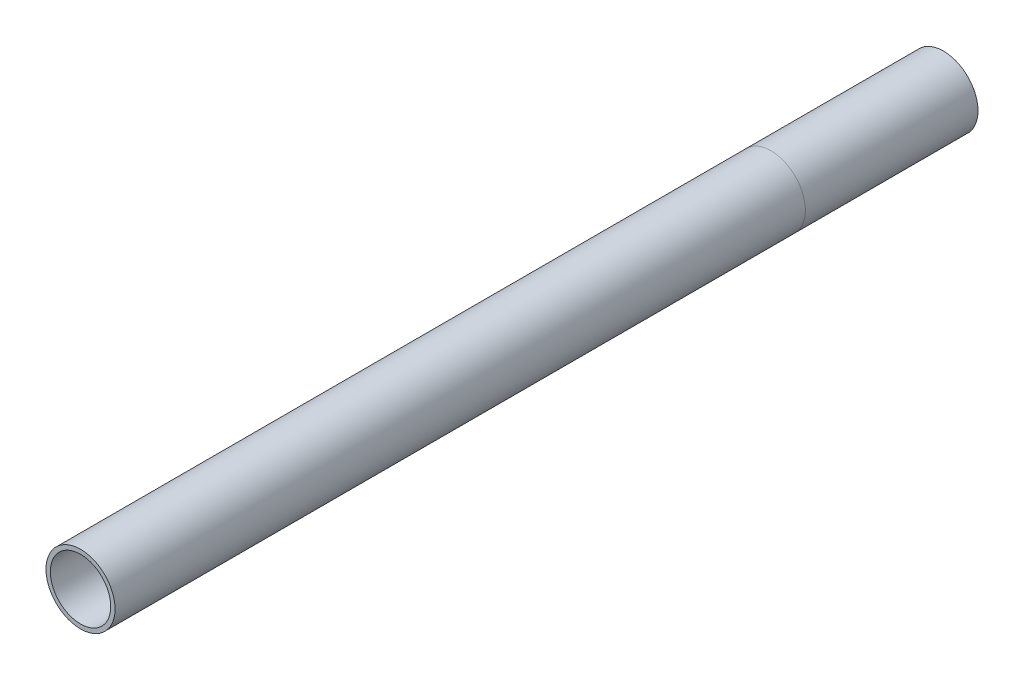
ISO-10303-21;
HEADER;
FILE_DESCRIPTION(('STEP AP214'),'2;1');
FILE_NAME('part.step','',(''),(''),'','','');
FILE_SCHEMA(('AUTOMOTIVE_DESIGN { 1 0 10303 214 1 1 1 1 }'));
ENDSEC;
DATA;
#1=APPLICATION_CONTEXT('core data for automotive mechanical design processes');
#2=APPLICATION_PROTOCOL_DEFINITION('international standard','automotive_design',2000,#1);
#3=PRODUCT_CONTEXT('',#1,'mechanical');
#4=PRODUCT('Part','Part','',(#3));
#5=PRODUCT_RELATED_PRODUCT_CATEGORY('part','',(#4));
#6=PRODUCT_DEFINITION_FORMATION('','',#4);
#7=PRODUCT_DEFINITION_CONTEXT('part definition',#1,'design');
#8=PRODUCT_DEFINITION('design','',#6,#7);
#9=PRODUCT_DEFINITION_SHAPE('','',#8);
#10=(LENGTH_UNIT() NAMED_UNIT(*) SI_UNIT(.MILLI.,.METRE.));
#11=(NAMED_UNIT(*) PLANE_ANGLE_UNIT() SI_UNIT($,.RADIAN.));
#12=(NAMED_UNIT(*) SI_UNIT($,.STERADIAN.) SOLID_ANGLE_UNIT());
#13=UNCERTAINTY_MEASURE_WITH_UNIT(LENGTH_MEASURE(1.E-05),#10,'distance_accuracy_value','');
#14=(GEOMETRIC_REPRESENTATION_CONTEXT(3) GLOBAL_UNCERTAINTY_ASSIGNED_CONTEXT((#13)) GLOBAL_UNIT_ASSIGNED_CONTEXT((#10,
#11,#12)) REPRESENTATION_CONTEXT('',''));
#15=CARTESIAN_POINT('',(0.,0.,0.));
#16=DIRECTION('',(0.,0.,1.));
#17=DIRECTION('',(1.,0.,0.));
#18=AXIS2_PLACEMENT_3D('',#15,#16,#17);
#19=CARTESIAN_POINT('',(0.,0.,200.));
#20=DIRECTION('',(0.,0.,-1.));
#21=DIRECTION('',(-1.,0.,0.));
#22=AXIS2_PLACEMENT_3D('',#19,#20,#21);
#23=CYLINDRICAL_SURFACE('',#22,8.);
#24=CARTESIAN_POINT('',(0.,0.,200.));
#25=DIRECTION('',(0.,0.,1.));
#26=DIRECTION('',(1.,0.,0.));
#27=AXIS2_PLACEMENT_3D('',#24,#25,#26);
#28=CIRCLE('',#27,8.);
#29=CARTESIAN_POINT('',(8.,0.,200.));
#30=VERTEX_POINT('',#29);
#31=EDGE_CURVE('E44',#30,#30,#28,.T.);
#32=ORIENTED_EDGE('',*,*,#31,.F.);
#33=EDGE_LOOP('',(#32));
#34=FACE_BOUND('',#33,.T.);
#35=CARTESIAN_POINT('',(0.,0.,40.));
#36=DIRECTION('',(0.,0.,-1.));
#37=DIRECTION('',(-1.,0.,0.));
#38=AXIS2_PLACEMENT_3D('',#35,#36,#37);
#39=CIRCLE('',#38,8.);
#40=CARTESIAN_POINT('',(-8.,0.,40.));
#41=VERTEX_POINT('',#40);
#42=EDGE_CURVE('E10',#41,#41,#39,.T.);
#43=ORIENTED_EDGE('',*,*,#42,.F.);
#44=EDGE_LOOP('',(#43));
#45=FACE_BOUND('',#44,.T.);
#46=ADVANCED_FACE('F36',(#34,#45),#23,.T.);
#47=CARTESIAN_POINT('',(0.,0.,200.));
#48=DIRECTION('',(0.,0.,1.));
#49=DIRECTION('',(1.,0.,0.));
#50=AXIS2_PLACEMENT_3D('',#47,#48,#49);
#51=PLANE('',#50);
#52=ORIENTED_EDGE('',*,*,#31,.T.);
#53=EDGE_LOOP('',(#52));
#54=FACE_BOUND('',#53,.T.);
#55=CARTESIAN_POINT('',(0.,0.,200.));
#56=DIRECTION('',(0.,0.,1.));
#57=DIRECTION('',(1.,0.,0.));
#58=AXIS2_PLACEMENT_3D('',#55,#56,#57);
#59=CIRCLE('',#58,7.);
#60=CARTESIAN_POINT('',(7.,0.,200.));
#61=VERTEX_POINT('',#60);
#62=EDGE_CURVE('E55',#61,#61,#59,.T.);
#63=ORIENTED_EDGE('',*,*,#62,.F.);
#64=EDGE_LOOP('',(#63));
#65=FACE_BOUND('',#64,.T.);
#66=ADVANCED_FACE('F66',(#54,#65),#51,.T.);
#67=CARTESIAN_POINT('',(0.,0.,0.));
#68=DIRECTION('',(0.,0.,1.));
#69=DIRECTION('',(1.,0.,0.));
#70=AXIS2_PLACEMENT_3D('',#67,#68,#69);
#71=PLANE('',#70);
#72=CARTESIAN_POINT('',(0.,0.,0.));
#73=DIRECTION('',(0.,0.,1.));
#74=DIRECTION('',(1.,0.,0.));
#75=AXIS2_PLACEMENT_3D('',#72,#73,#74);
#76=CIRCLE('',#75,8.);
#77=CARTESIAN_POINT('',(8.,0.,0.));
#78=VERTEX_POINT('',#77);
#79=EDGE_CURVE('E50',#78,#78,#76,.T.);
#80=ORIENTED_EDGE('',*,*,#79,.F.);
#81=EDGE_LOOP('',(#80));
#82=FACE_BOUND('',#81,.T.);
#83=CARTESIAN_POINT('',(0.,0.,0.));
#84=DIRECTION('',(0.,0.,1.));
#85=DIRECTION('',(1.,0.,0.));
#86=AXIS2_PLACEMENT_3D('',#83,#84,#85);
#87=CIRCLE('',#86,7.);
#88=CARTESIAN_POINT('',(7.,0.,0.));
#89=VERTEX_POINT('',#88);
#90=EDGE_CURVE('E57',#89,#89,#87,.T.);
#91=ORIENTED_EDGE('',*,*,#90,.T.);
#92=EDGE_LOOP('',(#91));
#93=FACE_BOUND('',#92,.T.);
#94=ADVANCED_FACE('F68',(#82,#93),#71,.F.);
#95=ORIENTED_EDGE('',*,*,#42,.T.);
#96=EDGE_LOOP('',(#95));
#97=FACE_BOUND('',#96,.T.);
#98=ORIENTED_EDGE('',*,*,#79,.T.);
#99=EDGE_LOOP('',(#98));
#100=FACE_BOUND('',#99,.T.);
#101=ADVANCED_FACE('F38',(#97,#100),#23,.T.);
#102=CARTESIAN_POINT('',(0.,0.,200.));
#103=DIRECTION('',(0.,0.,-1.));
#104=DIRECTION('',(-1.,0.,0.));
#105=AXIS2_PLACEMENT_3D('',#102,#103,#104);
#106=CYLINDRICAL_SURFACE('',#105,7.);
#107=ORIENTED_EDGE('',*,*,#62,.T.);
#108=EDGE_LOOP('',(#107));
#109=FACE_BOUND('',#108,.T.);
#110=ORIENTED_EDGE('',*,*,#90,.F.);
#111=EDGE_LOOP('',(#110));
#112=FACE_BOUND('',#111,.T.);
#113=ADVANCED_FACE('F63',(#109,#112),#106,.F.);
#114=CLOSED_SHELL('',(#46,#66,#94,#101,#113));
#115=MANIFOLD_SOLID_BREP('B2',#114);
#116=ADVANCED_BREP_SHAPE_REPRESENTATION('',(#18,#115),#14);
#117=SHAPE_DEFINITION_REPRESENTATION(#9,#116);
ENDSEC;
END-ISO-10303-21;
